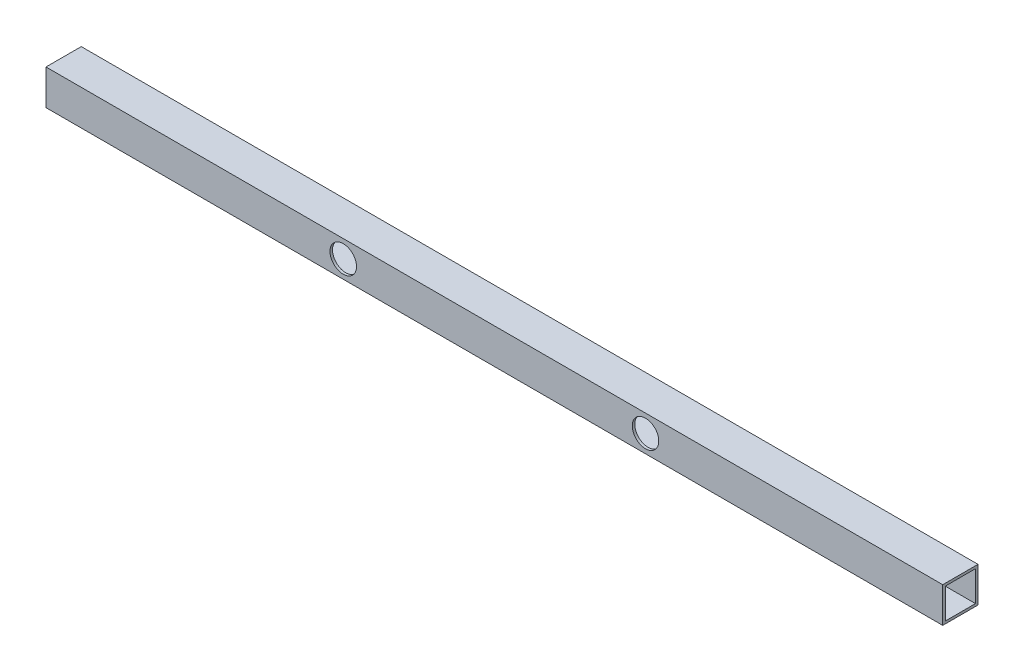
ISO-10303-21;
HEADER;
FILE_DESCRIPTION(('STEP AP214'),'2;1');
FILE_NAME('part.step','',(''),(''),'','','');
FILE_SCHEMA(('AUTOMOTIVE_DESIGN { 1 0 10303 214 1 1 1 1 }'));
ENDSEC;
DATA;
#1=APPLICATION_CONTEXT('core data for automotive mechanical design processes');
#2=APPLICATION_PROTOCOL_DEFINITION('international standard','automotive_design',2000,#1);
#3=PRODUCT_CONTEXT('',#1,'mechanical');
#4=PRODUCT('Part','Part','',(#3));
#5=PRODUCT_RELATED_PRODUCT_CATEGORY('part','',(#4));
#6=PRODUCT_DEFINITION_FORMATION('','',#4);
#7=PRODUCT_DEFINITION_CONTEXT('part definition',#1,'design');
#8=PRODUCT_DEFINITION('design','',#6,#7);
#9=PRODUCT_DEFINITION_SHAPE('','',#8);
#10=(LENGTH_UNIT() NAMED_UNIT(*) SI_UNIT(.MILLI.,.METRE.));
#11=(NAMED_UNIT(*) PLANE_ANGLE_UNIT() SI_UNIT($,.RADIAN.));
#12=(NAMED_UNIT(*) SI_UNIT($,.STERADIAN.) SOLID_ANGLE_UNIT());
#13=UNCERTAINTY_MEASURE_WITH_UNIT(LENGTH_MEASURE(1.E-05),#10,'distance_accuracy_value','');
#14=(GEOMETRIC_REPRESENTATION_CONTEXT(3) GLOBAL_UNCERTAINTY_ASSIGNED_CONTEXT((#13)) GLOBAL_UNIT_ASSIGNED_CONTEXT((#10,
#11,#12)) REPRESENTATION_CONTEXT('',''));
#15=CARTESIAN_POINT('',(0.,0.,0.));
#16=DIRECTION('',(0.,0.,1.));
#17=DIRECTION('',(1.,0.,0.));
#18=AXIS2_PLACEMENT_3D('',#15,#16,#17);
#19=CARTESIAN_POINT('',(-190.500000000002,2.88657986402541E-12,12.6999999999987));
#20=DIRECTION('',(0.,0.,-0.999999999999986));
#21=DIRECTION('',(-1.,0.,0.));
#22=AXIS2_PLACEMENT_3D('',#19,#20,#21);
#23=CYLINDRICAL_SURFACE('',#22,16.7005);
#24=CARTESIAN_POINT('',(-190.500000000005,2.88657986402541E-12,44.4499999999987));
#25=DIRECTION('',(0.,0.,-0.999999999999986));
#26=DIRECTION('',(-1.,0.,0.));
#27=AXIS2_PLACEMENT_3D('',#24,#25,#26);
#28=CIRCLE('',#27,16.7005);
#29=CARTESIAN_POINT('',(-207.200500000005,2.98102696565885E-12,44.4499999999987));
#30=VERTEX_POINT('',#29);
#31=EDGE_CURVE('E118',#30,#30,#28,.T.);
#32=ORIENTED_EDGE('',*,*,#31,.F.);
#33=EDGE_LOOP('',(#32));
#34=FACE_BOUND('',#33,.T.);
#35=CARTESIAN_POINT('',(-190.5,2.88657986402541E-12,41.2749999999987));
#36=DIRECTION('',(0.,0.,-0.999999999999986));
#37=DIRECTION('',(-1.,0.,0.));
#38=AXIS2_PLACEMENT_3D('',#35,#36,#37);
#39=CIRCLE('',#38,16.7005);
#40=CARTESIAN_POINT('',(-207.2005,2.98102696565885E-12,41.2749999999987));
#41=VERTEX_POINT('',#40);
#42=EDGE_CURVE('E17',#41,#41,#39,.T.);
#43=ORIENTED_EDGE('',*,*,#42,.T.);
#44=EDGE_LOOP('',(#43));
#45=FACE_BOUND('',#44,.T.);
#46=ADVANCED_FACE('F14',(#34,#45),#23,.F.);
#47=CARTESIAN_POINT('',(190.500000000002,2.33146835171283E-12,12.7000000000002));
#48=DIRECTION('',(0.,0.,-0.999999999999986));
#49=DIRECTION('',(-1.,0.,0.));
#50=AXIS2_PLACEMENT_3D('',#47,#48,#49);
#51=CYLINDRICAL_SURFACE('',#50,16.7005);
#52=CARTESIAN_POINT('',(190.500000000001,-3.33066907387547E-13,44.45));
#53=DIRECTION('',(0.,0.,-0.999999999999986));
#54=DIRECTION('',(-1.,0.,0.));
#55=AXIS2_PLACEMENT_3D('',#52,#53,#54);
#56=CIRCLE('',#55,16.7005);
#57=CARTESIAN_POINT('',(173.799500000001,-2.38619805754101E-13,44.45));
#58=VERTEX_POINT('',#57);
#59=EDGE_CURVE('E113',#58,#58,#56,.T.);
#60=ORIENTED_EDGE('',*,*,#59,.F.);
#61=EDGE_LOOP('',(#60));
#62=FACE_BOUND('',#61,.T.);
#63=CARTESIAN_POINT('',(190.500000000003,-3.33066907387547E-13,41.2750000000003));
#64=DIRECTION('',(0.,0.,-0.999999999999986));
#65=DIRECTION('',(-1.,0.,0.));
#66=AXIS2_PLACEMENT_3D('',#63,#64,#65);
#67=CIRCLE('',#66,16.7005);
#68=CARTESIAN_POINT('',(173.799500000003,-2.38619805754101E-13,41.2750000000003));
#69=VERTEX_POINT('',#68);
#70=EDGE_CURVE('E110',#69,#69,#67,.T.);
#71=ORIENTED_EDGE('',*,*,#70,.T.);
#72=EDGE_LOOP('',(#71));
#73=FACE_BOUND('',#72,.T.);
#74=ADVANCED_FACE('F125',(#62,#73),#51,.F.);
#75=CARTESIAN_POINT('',(565.152000000002,-19.0500000000029,44.45));
#76=DIRECTION('',(0.,-0.999999999999995,0.));
#77=DIRECTION('',(0.,0.,-0.999999999999986));
#78=AXIS2_PLACEMENT_3D('',#75,#76,#77);
#79=PLANE('',#78);
#80=DIRECTION('',(0.,0.,-0.999999999999986));
#81=VECTOR('',#80,1.);
#82=CARTESIAN_POINT('',(-565.149999999998,-19.0499999999943,44.4499999999987));
#83=LINE('',#82,#81);
#84=CARTESIAN_POINT('',(-565.150000000005,-19.0499999999968,3.17499999999998));
#85=VERTEX_POINT('',#84);
#86=CARTESIAN_POINT('',(-565.15,-19.0499999999943,41.2749999999987));
#87=VERTEX_POINT('',#86);
#88=EDGE_CURVE('E101',#85,#87,#83,.F.);
#89=ORIENTED_EDGE('',*,*,#88,.T.);
#90=DIRECTION('',(1.,0.,0.));
#91=VECTOR('',#90,1.);
#92=CARTESIAN_POINT('',(565.152000000002,-19.0500000000029,41.2750000000005));
#93=LINE('',#92,#91);
#94=CARTESIAN_POINT('',(565.150000000005,-19.0500000000029,41.2749999999999));
#95=VERTEX_POINT('',#94);
#96=EDGE_CURVE('E111',#87,#95,#93,.T.);
#97=ORIENTED_EDGE('',*,*,#96,.T.);
#98=DIRECTION('',(0.,0.,-0.999999999999986));
#99=VECTOR('',#98,1.);
#100=CARTESIAN_POINT('',(565.150000000005,-19.0500000000029,44.4500000000002));
#101=LINE('',#100,#99);
#102=CARTESIAN_POINT('',(565.15,-19.0500000000003,3.17499999999998));
#103=VERTEX_POINT('',#102);
#104=EDGE_CURVE('E116',#103,#95,#101,.F.);
#105=ORIENTED_EDGE('',*,*,#104,.F.);
#106=DIRECTION('',(-1.,0.,0.));
#107=VECTOR('',#106,1.);
#108=CARTESIAN_POINT('',(565.152,-19.0500000000027,3.17499999999976));
#109=LINE('',#108,#107);
#110=EDGE_CURVE('E98',#103,#85,#109,.T.);
#111=ORIENTED_EDGE('',*,*,#110,.T.);
#112=EDGE_LOOP('',(#89,#97,#105,#111));
#113=FACE_BOUND('',#112,.T.);
#114=ADVANCED_FACE('F130',(#113),#79,.F.);
#115=CARTESIAN_POINT('',(565.152000000005,-2.99760216648792E-12,41.2749999999991));
#116=DIRECTION('',(0.,0.,0.999999999999986));
#117=DIRECTION('',(1.,0.,0.));
#118=AXIS2_PLACEMENT_3D('',#115,#116,#117);
#119=PLANE('',#118);
#120=ORIENTED_EDGE('',*,*,#70,.F.);
#121=EDGE_LOOP('',(#120));
#122=FACE_BOUND('',#121,.T.);
#123=DIRECTION('',(0.,0.999999999999995,0.));
#124=VECTOR('',#123,1.);
#125=CARTESIAN_POINT('',(-565.15,5.55111512312578E-12,41.2749999999987));
#126=LINE('',#125,#124);
#127=CARTESIAN_POINT('',(-565.15,19.0500000000048,41.2749999999999));
#128=VERTEX_POINT('',#127);
#129=EDGE_CURVE('E103',#87,#128,#126,.T.);
#130=ORIENTED_EDGE('',*,*,#129,.T.);
#131=DIRECTION('',(1.,0.,0.));
#132=VECTOR('',#131,1.);
#133=CARTESIAN_POINT('',(565.152000000005,19.0499999999967,41.2750000000004));
#134=LINE('',#133,#132);
#135=CARTESIAN_POINT('',(565.150000000005,19.0499999999967,41.2749999999998));
#136=VERTEX_POINT('',#135);
#137=EDGE_CURVE('E76',#128,#136,#134,.T.);
#138=ORIENTED_EDGE('',*,*,#137,.T.);
#139=DIRECTION('',(0.,0.999999999999995,0.));
#140=VECTOR('',#139,1.);
#141=CARTESIAN_POINT('',(565.150000000005,-2.99760216648792E-12,41.2749999999986));
#142=LINE('',#141,#140);
#143=EDGE_CURVE('E182',#95,#136,#142,.T.);
#144=ORIENTED_EDGE('',*,*,#143,.F.);
#145=ORIENTED_EDGE('',*,*,#96,.F.);
#146=EDGE_LOOP('',(#130,#138,#144,#145));
#147=FACE_BOUND('',#146,.T.);
#148=ORIENTED_EDGE('',*,*,#42,.F.);
#149=EDGE_LOOP('',(#148));
#150=FACE_BOUND('',#149,.T.);
#151=ADVANCED_FACE('F127',(#122,#147,#150),#119,.F.);
#152=CARTESIAN_POINT('',(565.152000000005,19.0499999999967,44.4499999999999));
#153=DIRECTION('',(0.,0.999999999999995,0.));
#154=DIRECTION('',(0.,0.,0.999999999999986));
#155=AXIS2_PLACEMENT_3D('',#152,#153,#154);
#156=PLANE('',#155);
#157=DIRECTION('',(0.,0.,-0.999999999999986));
#158=VECTOR('',#157,1.);
#159=CARTESIAN_POINT('',(-565.149999999998,19.0500000000048,44.4499999999999));
#160=LINE('',#159,#158);
#161=CARTESIAN_POINT('',(-565.150000000005,19.0500000000021,3.17500000000004));
#162=VERTEX_POINT('',#161);
#163=EDGE_CURVE('E79',#128,#162,#160,.T.);
#164=ORIENTED_EDGE('',*,*,#163,.T.);
#165=DIRECTION('',(-1.,0.,0.));
#166=VECTOR('',#165,1.);
#167=CARTESIAN_POINT('',(565.152000000004,19.049999999997,3.17499999999982));
#168=LINE('',#167,#166);
#169=CARTESIAN_POINT('',(565.150000000004,19.0499999999993,3.17499999999998));
#170=VERTEX_POINT('',#169);
#171=EDGE_CURVE('E82',#162,#170,#168,.F.);
#172=ORIENTED_EDGE('',*,*,#171,.T.);
#173=DIRECTION('',(0.,0.,-0.999999999999986));
#174=VECTOR('',#173,1.);
#175=CARTESIAN_POINT('',(565.150000000005,19.0499999999967,44.45));
#176=LINE('',#175,#174);
#177=EDGE_CURVE('E193',#136,#170,#176,.T.);
#178=ORIENTED_EDGE('',*,*,#177,.F.);
#179=ORIENTED_EDGE('',*,*,#137,.F.);
#180=EDGE_LOOP('',(#164,#172,#178,#179));
#181=FACE_BOUND('',#180,.T.);
#182=ADVANCED_FACE('F81',(#181),#156,.F.);
#183=CARTESIAN_POINT('',(565.152,-2.692290834716E-12,3.17499999999976));
#184=DIRECTION('',(0.,0.,-0.999999999999986));
#185=DIRECTION('',(-1.,0.,0.));
#186=AXIS2_PLACEMENT_3D('',#183,#184,#185);
#187=PLANE('',#186);
#188=DIRECTION('',(0.,0.999999999999995,0.));
#189=VECTOR('',#188,1.);
#190=CARTESIAN_POINT('',(-565.150000000005,2.99760216648792E-12,3.17499999999876));
#191=LINE('',#190,#189);
#192=EDGE_CURVE('E87',#162,#85,#191,.F.);
#193=ORIENTED_EDGE('',*,*,#192,.T.);
#194=ORIENTED_EDGE('',*,*,#110,.F.);
#195=DIRECTION('',(0.,0.999999999999995,0.));
#196=VECTOR('',#195,1.);
#197=CARTESIAN_POINT('',(565.15,-3.33066907387547E-13,3.17499999999998));
#198=LINE('',#197,#196);
#199=EDGE_CURVE('E96',#170,#103,#198,.F.);
#200=ORIENTED_EDGE('',*,*,#199,.F.);
#201=ORIENTED_EDGE('',*,*,#171,.F.);
#202=EDGE_LOOP('',(#193,#194,#200,#201));
#203=FACE_BOUND('',#202,.T.);
#204=ADVANCED_FACE('F92',(#203),#187,.F.);
#205=CARTESIAN_POINT('',(-2.55351295663786E-12,-22.2249999999987,44.4499999999999));
#206=DIRECTION('',(0.,0.999999999999995,0.));
#207=DIRECTION('',(0.,0.,0.999999999999986));
#208=AXIS2_PLACEMENT_3D('',#205,#206,#207);
#209=PLANE('',#208);
#210=DIRECTION('',(0.,0.,-0.999999999999986));
#211=VECTOR('',#210,1.);
#212=CARTESIAN_POINT('',(565.150000000005,-22.2250000000017,44.4500000000002));
#213=LINE('',#212,#211);
#214=CARTESIAN_POINT('',(565.150000000005,-22.2250000000017,44.4500000000002));
#215=VERTEX_POINT('',#214);
#216=CARTESIAN_POINT('',(565.150000000004,-22.2250000000029,0.));
#217=VERTEX_POINT('',#216);
#218=EDGE_CURVE('E200',#215,#217,#213,.T.);
#219=ORIENTED_EDGE('',*,*,#218,.F.);
#220=DIRECTION('',(1.,0.,0.));
#221=VECTOR('',#220,1.);
#222=CARTESIAN_POINT('',(-2.55351295663786E-12,-22.2249999999987,44.4499999999999));
#223=LINE('',#222,#221);
#224=CARTESIAN_POINT('',(-565.149999999998,-22.2249999999957,44.45));
#225=VERTEX_POINT('',#224);
#226=EDGE_CURVE('E117',#225,#215,#223,.T.);
#227=ORIENTED_EDGE('',*,*,#226,.F.);
#228=DIRECTION('',(0.,0.,-0.999999999999986));
#229=VECTOR('',#228,1.);
#230=CARTESIAN_POINT('',(-565.149999999998,-22.2249999999957,44.45));
#231=LINE('',#230,#229);
#232=CARTESIAN_POINT('',(-565.150000000001,-22.2249999999955,0.));
#233=VERTEX_POINT('',#232);
#234=EDGE_CURVE('E184',#225,#233,#231,.T.);
#235=ORIENTED_EDGE('',*,*,#234,.T.);
#236=DIRECTION('',(1.,0.,0.));
#237=VECTOR('',#236,1.);
#238=CARTESIAN_POINT('',(0.,-22.2249999999987,0.));
#239=LINE('',#238,#237);
#240=EDGE_CURVE('E88',#233,#217,#239,.T.);
#241=ORIENTED_EDGE('',*,*,#240,.T.);
#242=EDGE_LOOP('',(#219,#227,#235,#241));
#243=FACE_BOUND('',#242,.T.);
#244=ADVANCED_FACE('F167',(#243),#209,.F.);
#245=CARTESIAN_POINT('',(0.,0.,0.));
#246=DIRECTION('',(0.,0.,0.999999999999986));
#247=DIRECTION('',(1.,0.,0.));
#248=AXIS2_PLACEMENT_3D('',#245,#246,#247);
#249=PLANE('',#248);
#250=DIRECTION('',(0.,0.999999999999995,0.));
#251=VECTOR('',#250,1.);
#252=CARTESIAN_POINT('',(565.150000000004,-3.33066907387547E-13,0.));
#253=LINE('',#252,#251);
#254=CARTESIAN_POINT('',(565.150000000004,22.2249999999994,1.22124532708767E-12));
#255=VERTEX_POINT('',#254);
#256=EDGE_CURVE('E196',#217,#255,#253,.T.);
#257=ORIENTED_EDGE('',*,*,#256,.F.);
#258=ORIENTED_EDGE('',*,*,#240,.F.);
#259=DIRECTION('',(0.,0.999999999999995,0.));
#260=VECTOR('',#259,1.);
#261=CARTESIAN_POINT('',(-565.150000000002,2.99760216648792E-12,-1.4432899320127E-12));
#262=LINE('',#261,#260);
#263=CARTESIAN_POINT('',(-565.150000000002,22.2250000000022,1.0547118733939E-12));
#264=VERTEX_POINT('',#263);
#265=EDGE_CURVE('E121',#233,#264,#262,.T.);
#266=ORIENTED_EDGE('',*,*,#265,.T.);
#267=DIRECTION('',(1.,0.,0.));
#268=VECTOR('',#267,1.);
#269=CARTESIAN_POINT('',(2.1094237467878E-12,22.2249999999995,2.60902410786912E-12));
#270=LINE('',#269,#268);
#271=EDGE_CURVE('E203',#255,#264,#270,.F.);
#272=ORIENTED_EDGE('',*,*,#271,.F.);
#273=EDGE_LOOP('',(#257,#258,#266,#272));
#274=FACE_BOUND('',#273,.T.);
#275=ADVANCED_FACE('F163',(#274),#249,.F.);
#276=CARTESIAN_POINT('',(-565.149999999998,5.55111512312578E-12,44.4499999999987));
#277=DIRECTION('',(1.,0.,0.));
#278=DIRECTION('',(0.,0.,-0.999999999999986));
#279=AXIS2_PLACEMENT_3D('',#276,#277,#278);
#280=PLANE('',#279);
#281=ORIENTED_EDGE('',*,*,#234,.F.);
#282=DIRECTION('',(0.,0.999999999999995,0.));
#283=VECTOR('',#282,1.);
#284=CARTESIAN_POINT('',(-565.149999999998,5.55111512312578E-12,44.4499999999987));
#285=LINE('',#284,#283);
#286=CARTESIAN_POINT('',(-565.149999999998,22.2250000000047,44.4500000000012));
#287=VERTEX_POINT('',#286);
#288=EDGE_CURVE('E120',#287,#225,#285,.F.);
#289=ORIENTED_EDGE('',*,*,#288,.F.);
#290=DIRECTION('',(0.,0.,0.999999999999986));
#291=VECTOR('',#290,1.);
#292=CARTESIAN_POINT('',(-565.149999999998,22.2250000000047,44.4500000000012));
#293=LINE('',#292,#291);
#294=EDGE_CURVE('E206',#264,#287,#293,.T.);
#295=ORIENTED_EDGE('',*,*,#294,.F.);
#296=ORIENTED_EDGE('',*,*,#265,.F.);
#297=EDGE_LOOP('',(#281,#289,#295,#296));
#298=FACE_BOUND('',#297,.T.);
#299=ORIENTED_EDGE('',*,*,#88,.F.);
#300=ORIENTED_EDGE('',*,*,#192,.F.);
#301=ORIENTED_EDGE('',*,*,#163,.F.);
#302=ORIENTED_EDGE('',*,*,#129,.F.);
#303=EDGE_LOOP('',(#299,#300,#301,#302));
#304=FACE_BOUND('',#303,.T.);
#305=ADVANCED_FACE('F100',(#298,#304),#280,.F.);
#306=CARTESIAN_POINT('',(-2.55351295663786E-12,0.,44.4499999999999));
#307=DIRECTION('',(0.,0.,0.999999999999986));
#308=DIRECTION('',(1.,0.,0.));
#309=AXIS2_PLACEMENT_3D('',#306,#307,#308);
#310=PLANE('',#309);
#311=ORIENTED_EDGE('',*,*,#59,.T.);
#312=EDGE_LOOP('',(#311));
#313=FACE_BOUND('',#312,.T.);
#314=ORIENTED_EDGE('',*,*,#226,.T.);
#315=DIRECTION('',(0.,0.999999999999995,0.));
#316=VECTOR('',#315,1.);
#317=CARTESIAN_POINT('',(565.150000000005,-2.99760216648792E-12,44.4499999999988));
#318=LINE('',#317,#316);
#319=CARTESIAN_POINT('',(565.150000000005,22.2249999999967,44.4500000000014));
#320=VERTEX_POINT('',#319);
#321=EDGE_CURVE('E32',#320,#215,#318,.F.);
#322=ORIENTED_EDGE('',*,*,#321,.F.);
#323=DIRECTION('',(1.,0.,0.));
#324=VECTOR('',#323,1.);
#325=CARTESIAN_POINT('',(-1.4432899320127E-12,22.2249999999995,44.4500000000023));
#326=LINE('',#325,#324);
#327=EDGE_CURVE('E23',#287,#320,#326,.T.);
#328=ORIENTED_EDGE('',*,*,#327,.F.);
#329=ORIENTED_EDGE('',*,*,#288,.T.);
#330=EDGE_LOOP('',(#314,#322,#328,#329));
#331=FACE_BOUND('',#330,.T.);
#332=ORIENTED_EDGE('',*,*,#31,.T.);
#333=EDGE_LOOP('',(#332));
#334=FACE_BOUND('',#333,.T.);
#335=ADVANCED_FACE('F153',(#313,#331,#334),#310,.T.);
#336=CARTESIAN_POINT('',(565.150000000005,-2.99760216648792E-12,44.4499999999988));
#337=DIRECTION('',(1.,0.,0.));
#338=DIRECTION('',(0.,0.,-0.999999999999986));
#339=AXIS2_PLACEMENT_3D('',#336,#337,#338);
#340=PLANE('',#339);
#341=ORIENTED_EDGE('',*,*,#321,.T.);
#342=ORIENTED_EDGE('',*,*,#218,.T.);
#343=ORIENTED_EDGE('',*,*,#256,.T.);
#344=DIRECTION('',(0.,0.,0.999999999999986));
#345=VECTOR('',#344,1.);
#346=CARTESIAN_POINT('',(565.150000000005,22.2249999999967,44.4500000000014));
#347=LINE('',#346,#345);
#348=EDGE_CURVE('E9',#320,#255,#347,.F.);
#349=ORIENTED_EDGE('',*,*,#348,.F.);
#350=EDGE_LOOP('',(#341,#342,#343,#349));
#351=FACE_BOUND('',#350,.T.);
#352=ORIENTED_EDGE('',*,*,#177,.T.);
#353=ORIENTED_EDGE('',*,*,#199,.T.);
#354=ORIENTED_EDGE('',*,*,#104,.T.);
#355=ORIENTED_EDGE('',*,*,#143,.T.);
#356=EDGE_LOOP('',(#352,#353,#354,#355));
#357=FACE_BOUND('',#356,.T.);
#358=ADVANCED_FACE('F147',(#351,#357),#340,.T.);
#359=CARTESIAN_POINT('',(-1.4432899320127E-12,22.2249999999995,44.4500000000023));
#360=DIRECTION('',(0.,0.999999999999995,0.));
#361=DIRECTION('',(0.,0.,0.999999999999986));
#362=AXIS2_PLACEMENT_3D('',#359,#360,#361);
#363=PLANE('',#362);
#364=ORIENTED_EDGE('',*,*,#327,.T.);
#365=ORIENTED_EDGE('',*,*,#348,.T.);
#366=ORIENTED_EDGE('',*,*,#271,.T.);
#367=ORIENTED_EDGE('',*,*,#294,.T.);
#368=EDGE_LOOP('',(#364,#365,#366,#367));
#369=FACE_BOUND('',#368,.T.);
#370=ADVANCED_FACE('F145',(#369),#363,.T.);
#371=CLOSED_SHELL('',(#46,#74,#114,#151,#182,#204,#244,#275,#305,#335,#358,#370));
#372=MANIFOLD_SOLID_BREP('B1',#371);
#373=ADVANCED_BREP_SHAPE_REPRESENTATION('',(#18,#372),#14);
#374=SHAPE_DEFINITION_REPRESENTATION(#9,#373);
ENDSEC;
END-ISO-10303-21;
